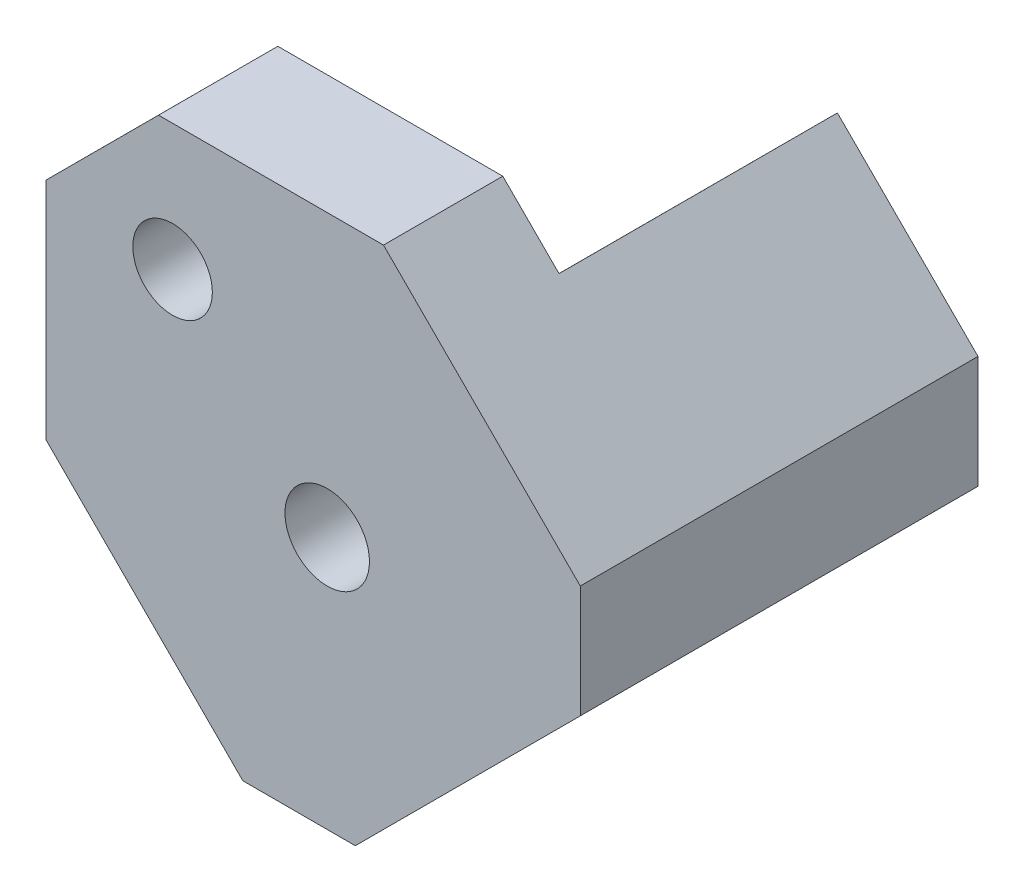
ISO-10303-21;
HEADER;
FILE_DESCRIPTION(('STEP AP214'),'2;1');
FILE_NAME('part.step','',(''),(''),'','','');
FILE_SCHEMA(('AUTOMOTIVE_DESIGN { 1 0 10303 214 1 1 1 1 }'));
ENDSEC;
DATA;
#1=APPLICATION_CONTEXT('core data for automotive mechanical design processes');
#2=APPLICATION_PROTOCOL_DEFINITION('international standard','automotive_design',2000,#1);
#3=PRODUCT_CONTEXT('',#1,'mechanical');
#4=PRODUCT('Part','Part','',(#3));
#5=PRODUCT_RELATED_PRODUCT_CATEGORY('part','',(#4));
#6=PRODUCT_DEFINITION_FORMATION('','',#4);
#7=PRODUCT_DEFINITION_CONTEXT('part definition',#1,'design');
#8=PRODUCT_DEFINITION('design','',#6,#7);
#9=PRODUCT_DEFINITION_SHAPE('','',#8);
#10=(LENGTH_UNIT() NAMED_UNIT(*) SI_UNIT(.MILLI.,.METRE.));
#11=(NAMED_UNIT(*) PLANE_ANGLE_UNIT() SI_UNIT($,.RADIAN.));
#12=(NAMED_UNIT(*) SI_UNIT($,.STERADIAN.) SOLID_ANGLE_UNIT());
#13=UNCERTAINTY_MEASURE_WITH_UNIT(LENGTH_MEASURE(1.E-05),#10,'distance_accuracy_value','');
#14=(GEOMETRIC_REPRESENTATION_CONTEXT(3) GLOBAL_UNCERTAINTY_ASSIGNED_CONTEXT((#13)) GLOBAL_UNIT_ASSIGNED_CONTEXT((#10,
#11,#12)) REPRESENTATION_CONTEXT('',''));
#15=CARTESIAN_POINT('',(0.,0.,0.));
#16=DIRECTION('',(0.,0.,1.));
#17=DIRECTION('',(1.,0.,0.));
#18=AXIS2_PLACEMENT_3D('',#15,#16,#17);
#19=CARTESIAN_POINT('',(97.1474811640959,-37.4199303249474,63.5));
#20=DIRECTION('',(-0.707188992132322,-0.707024560681502,0.));
#21=DIRECTION('',(0.707024560681502,-0.707188992132322,0.));
#22=AXIS2_PLACEMENT_3D('',#19,#20,#21);
#23=PLANE('',#22);
#24=DIRECTION('',(0.,0.,1.));
#25=VECTOR('',#24,1.);
#26=CARTESIAN_POINT('',(106.126693084751,-46.4012305250279,63.5));
#27=LINE('',#26,#25);
#28=CARTESIAN_POINT('',(106.126693084751,-46.4012305250279,0.));
#29=VERTEX_POINT('',#28);
#30=CARTESIAN_POINT('',(106.126693084751,-46.4012305250279,44.45));
#31=VERTEX_POINT('',#30);
#32=EDGE_CURVE('E66',#29,#31,#27,.T.);
#33=ORIENTED_EDGE('',*,*,#32,.T.);
#34=DIRECTION('',(-0.707024560681502,0.707188992132322,0.));
#35=VECTOR('',#34,1.);
#36=CARTESIAN_POINT('',(97.1474811640959,-37.4199303249474,44.45));
#37=LINE('',#36,#35);
#38=CARTESIAN_POINT('',(97.1474811640959,-37.4199303249474,44.45));
#39=VERTEX_POINT('',#38);
#40=EDGE_CURVE('E198',#31,#39,#37,.T.);
#41=ORIENTED_EDGE('',*,*,#40,.T.);
#42=DIRECTION('',(0.,0.,-1.));
#43=VECTOR('',#42,1.);
#44=CARTESIAN_POINT('',(97.1474811640959,-37.4199303249474,63.5));
#45=LINE('',#44,#43);
#46=CARTESIAN_POINT('',(97.1474811640959,-37.4199303249474,63.5));
#47=VERTEX_POINT('',#46);
#48=EDGE_CURVE('E13',#47,#39,#45,.T.);
#49=ORIENTED_EDGE('',*,*,#48,.F.);
#50=DIRECTION('',(-0.707024560681502,0.707188992132322,0.));
#51=VECTOR('',#50,1.);
#52=CARTESIAN_POINT('',(97.1474811640959,-37.4199303249474,63.5));
#53=LINE('',#52,#51);
#54=CARTESIAN_POINT('',(128.574722886389,-68.8544810252291,63.5));
#55=VERTEX_POINT('',#54);
#56=EDGE_CURVE('E160',#55,#47,#53,.T.);
#57=ORIENTED_EDGE('',*,*,#56,.F.);
#58=DIRECTION('',(0.,0.,-1.));
#59=VECTOR('',#58,1.);
#60=CARTESIAN_POINT('',(128.574722886389,-68.8544810252291,63.5));
#61=LINE('',#60,#59);
#62=CARTESIAN_POINT('',(128.574722886389,-68.8544810252291,0.));
#63=VERTEX_POINT('',#62);
#64=EDGE_CURVE('E161',#55,#63,#61,.T.);
#65=ORIENTED_EDGE('',*,*,#64,.T.);
#66=DIRECTION('',(-0.707024560681502,0.707188992132322,0.));
#67=VECTOR('',#66,1.);
#68=CARTESIAN_POINT('',(97.1474811640959,-37.4199303249474,0.));
#69=LINE('',#68,#67);
#70=EDGE_CURVE('E149',#63,#29,#69,.T.);
#71=ORIENTED_EDGE('',*,*,#70,.T.);
#72=EDGE_LOOP('',(#33,#41,#49,#57,#65,#71));
#73=FACE_BOUND('',#72,.T.);
#74=ADVANCED_FACE('F45',(#73),#23,.F.);
#75=CARTESIAN_POINT('',(61.2264569226248,-37.4157537660966,63.5));
#76=DIRECTION('',(-0.000116270593915752,-0.999999993240575,0.));
#77=DIRECTION('',(0.999999993240575,-0.000116270593915752,0.));
#78=AXIS2_PLACEMENT_3D('',#75,#76,#77);
#79=PLANE('',#78);
#80=ORIENTED_EDGE('',*,*,#48,.T.);
#81=DIRECTION('',(-0.999999993240575,0.000116270593915752,0.));
#82=VECTOR('',#81,1.);
#83=CARTESIAN_POINT('',(61.2264569226248,-37.4157537660966,44.45));
#84=LINE('',#83,#82);
#85=CARTESIAN_POINT('',(61.2264569226248,-37.4157537660965,44.45));
#86=VERTEX_POINT('',#85);
#87=EDGE_CURVE('E187',#39,#86,#84,.T.);
#88=ORIENTED_EDGE('',*,*,#87,.T.);
#89=DIRECTION('',(0.,0.,-1.));
#90=VECTOR('',#89,1.);
#91=CARTESIAN_POINT('',(61.2264569226248,-37.4157537660966,63.5));
#92=LINE('',#91,#90);
#93=CARTESIAN_POINT('',(61.2264569226248,-37.4157537660966,63.5));
#94=VERTEX_POINT('',#93);
#95=EDGE_CURVE('E53',#94,#86,#92,.T.);
#96=ORIENTED_EDGE('',*,*,#95,.F.);
#97=DIRECTION('',(-0.999999993240574,0.000116270593915752,0.));
#98=VECTOR('',#97,1.);
#99=CARTESIAN_POINT('',(61.2264569226248,-37.4157537660966,63.5));
#100=LINE('',#99,#98);
#101=EDGE_CURVE('E212',#47,#94,#100,.T.);
#102=ORIENTED_EDGE('',*,*,#101,.F.);
#103=EDGE_LOOP('',(#80,#88,#96,#102));
#104=FACE_BOUND('',#103,.T.);
#105=ADVANCED_FACE('F236',(#104),#79,.F.);
#106=CARTESIAN_POINT('',(61.2264569226248,-37.4157537660966,63.5));
#107=DIRECTION('',(0.707024560681502,-0.707188992132322,0.));
#108=DIRECTION('',(0.707188992132322,0.707024560681502,0.));
#109=AXIS2_PLACEMENT_3D('',#106,#107,#108);
#110=PLANE('',#109);
#111=ORIENTED_EDGE('',*,*,#95,.T.);
#112=DIRECTION('',(-0.707188992132322,-0.707024560681502,0.));
#113=VECTOR('',#112,1.);
#114=CARTESIAN_POINT('',(94.9084205273366,-3.7416216946858,44.45));
#115=LINE('',#114,#113);
#116=CARTESIAN_POINT('',(43.2638565224639,-55.3741776074067,44.45));
#117=VERTEX_POINT('',#116);
#118=EDGE_CURVE('E183',#86,#117,#115,.T.);
#119=ORIENTED_EDGE('',*,*,#118,.T.);
#120=DIRECTION('',(0.,0.,-1.));
#121=VECTOR('',#120,1.);
#122=CARTESIAN_POINT('',(43.2638565224638,-55.3741776074067,63.5));
#123=LINE('',#122,#121);
#124=CARTESIAN_POINT('',(43.2638565224638,-55.3741776074067,63.5));
#125=VERTEX_POINT('',#124);
#126=EDGE_CURVE('E176',#125,#117,#123,.T.);
#127=ORIENTED_EDGE('',*,*,#126,.F.);
#128=DIRECTION('',(-0.707188992132322,-0.707024560681502,0.));
#129=VECTOR('',#128,1.);
#130=CARTESIAN_POINT('',(61.2264569226248,-37.4157537660966,63.5));
#131=LINE('',#130,#129);
#132=EDGE_CURVE('E214',#94,#125,#131,.T.);
#133=ORIENTED_EDGE('',*,*,#132,.F.);
#134=EDGE_LOOP('',(#111,#119,#127,#133));
#135=FACE_BOUND('',#134,.T.);
#136=ADVANCED_FACE('F241',(#135),#110,.F.);
#137=CARTESIAN_POINT('',(43.2638565224638,-55.3741776074067,63.5));
#138=DIRECTION('',(0.999999993240575,-0.000116270593915559,0.));
#139=DIRECTION('',(0.000116270593915559,0.999999993240575,0.));
#140=AXIS2_PLACEMENT_3D('',#137,#138,#139);
#141=PLANE('',#140);
#142=ORIENTED_EDGE('',*,*,#126,.T.);
#143=DIRECTION('',(-0.000116270593915559,-0.999999993240575,0.));
#144=VECTOR('',#143,1.);
#145=CARTESIAN_POINT('',(43.2638565224638,-55.3741776074067,44.45));
#146=LINE('',#145,#144);
#147=CARTESIAN_POINT('',(43.259679963613,-91.2952018488778,44.45));
#148=VERTEX_POINT('',#147);
#149=EDGE_CURVE('E182',#117,#148,#146,.T.);
#150=ORIENTED_EDGE('',*,*,#149,.T.);
#151=DIRECTION('',(0.,0.,-1.));
#152=VECTOR('',#151,1.);
#153=CARTESIAN_POINT('',(43.259679963613,-91.2952018488778,63.5));
#154=LINE('',#153,#152);
#155=CARTESIAN_POINT('',(43.259679963613,-91.2952018488778,63.5));
#156=VERTEX_POINT('',#155);
#157=EDGE_CURVE('E174',#156,#148,#154,.T.);
#158=ORIENTED_EDGE('',*,*,#157,.F.);
#159=DIRECTION('',(-0.000116270593915559,-0.999999993240574,0.));
#160=VECTOR('',#159,1.);
#161=CARTESIAN_POINT('',(43.2638565224638,-55.3741776074067,63.5));
#162=LINE('',#161,#160);
#163=EDGE_CURVE('E216',#125,#156,#162,.T.);
#164=ORIENTED_EDGE('',*,*,#163,.F.);
#165=EDGE_LOOP('',(#142,#150,#158,#164));
#166=FACE_BOUND('',#165,.T.);
#167=ADVANCED_FACE('F243',(#166),#141,.F.);
#168=CARTESIAN_POINT('',(43.259679963613,-91.2952018488778,63.5));
#169=DIRECTION('',(0.707188992132322,0.707024560681502,0.));
#170=DIRECTION('',(-0.707024560681502,0.707188992132322,0.));
#171=AXIS2_PLACEMENT_3D('',#168,#169,#170);
#172=PLANE('',#171);
#173=ORIENTED_EDGE('',*,*,#157,.T.);
#174=DIRECTION('',(-0.707024560681501,0.707188992132322,0.));
#175=VECTOR('',#174,1.);
#176=CARTESIAN_POINT('',(52.2388918842681,-100.276502048958,44.45));
#177=LINE('',#176,#175);
#178=CARTESIAN_POINT('',(52.2388918842681,-100.276502048958,44.45));
#179=VERTEX_POINT('',#178);
#180=EDGE_CURVE('E134',#179,#148,#177,.T.);
#181=ORIENTED_EDGE('',*,*,#180,.F.);
#182=DIRECTION('',(0.,0.,1.));
#183=VECTOR('',#182,1.);
#184=CARTESIAN_POINT('',(52.2388918842681,-100.276502048958,0.));
#185=LINE('',#184,#183);
#186=CARTESIAN_POINT('',(52.2388918842681,-100.276502048958,0.));
#187=VERTEX_POINT('',#186);
#188=EDGE_CURVE('E127',#187,#179,#185,.T.);
#189=ORIENTED_EDGE('',*,*,#188,.F.);
#190=DIRECTION('',(0.707024560681502,-0.707188992132322,0.));
#191=VECTOR('',#190,1.);
#192=CARTESIAN_POINT('',(43.259679963613,-91.2952018488778,0.));
#193=LINE('',#192,#191);
#194=CARTESIAN_POINT('',(74.6869216859058,-122.72975254916,0.));
#195=VERTEX_POINT('',#194);
#196=EDGE_CURVE('E140',#187,#195,#193,.T.);
#197=ORIENTED_EDGE('',*,*,#196,.T.);
#198=DIRECTION('',(0.,0.,-1.));
#199=VECTOR('',#198,1.);
#200=CARTESIAN_POINT('',(74.6869216859058,-122.72975254916,63.5));
#201=LINE('',#200,#199);
#202=CARTESIAN_POINT('',(74.6869216859058,-122.72975254916,63.5));
#203=VERTEX_POINT('',#202);
#204=EDGE_CURVE('E172',#203,#195,#201,.T.);
#205=ORIENTED_EDGE('',*,*,#204,.F.);
#206=DIRECTION('',(0.707024560681502,-0.707188992132322,0.));
#207=VECTOR('',#206,1.);
#208=CARTESIAN_POINT('',(43.259679963613,-91.2952018488778,63.5));
#209=LINE('',#208,#207);
#210=EDGE_CURVE('E218',#156,#203,#209,.T.);
#211=ORIENTED_EDGE('',*,*,#210,.F.);
#212=EDGE_LOOP('',(#173,#181,#189,#197,#205,#211));
#213=FACE_BOUND('',#212,.T.);
#214=ADVANCED_FACE('F138',(#213),#172,.F.);
#215=CARTESIAN_POINT('',(92.6474338067014,-122.731840828525,63.5));
#216=DIRECTION('',(0.000116270590568872,0.999999993240575,0.));
#217=DIRECTION('',(-0.999999993240575,0.000116270590568872,0.));
#218=AXIS2_PLACEMENT_3D('',#215,#216,#217);
#219=PLANE('',#218);
#220=DIRECTION('',(0.999999993240575,-0.000116270590568872,0.));
#221=VECTOR('',#220,1.);
#222=CARTESIAN_POINT('',(92.6474338067014,-122.731840828525,0.));
#223=LINE('',#222,#221);
#224=CARTESIAN_POINT('',(92.6474338067014,-122.731840828525,0.));
#225=VERTEX_POINT('',#224);
#226=EDGE_CURVE('E148',#195,#225,#223,.T.);
#227=ORIENTED_EDGE('',*,*,#226,.T.);
#228=DIRECTION('',(0.,0.,-1.));
#229=VECTOR('',#228,1.);
#230=CARTESIAN_POINT('',(92.6474338067014,-122.731840828525,63.5));
#231=LINE('',#230,#229);
#232=CARTESIAN_POINT('',(92.6474338067014,-122.731840828525,25.4));
#233=VERTEX_POINT('',#232);
#234=EDGE_CURVE('E168',#233,#225,#231,.T.);
#235=ORIENTED_EDGE('',*,*,#234,.F.);
#236=CARTESIAN_POINT('',(92.6474338067014,-122.731840828525,63.5));
#237=VERTEX_POINT('',#236);
#238=EDGE_CURVE('E169',#237,#233,#231,.T.);
#239=ORIENTED_EDGE('',*,*,#238,.F.);
#240=DIRECTION('',(0.999999993240575,-0.000116270590568872,0.));
#241=VECTOR('',#240,1.);
#242=CARTESIAN_POINT('',(92.6474338067014,-122.731840828525,63.5));
#243=LINE('',#242,#241);
#244=EDGE_CURVE('E220',#203,#237,#243,.T.);
#245=ORIENTED_EDGE('',*,*,#244,.F.);
#246=ORIENTED_EDGE('',*,*,#204,.T.);
#247=EDGE_LOOP('',(#227,#235,#239,#245,#246));
#248=FACE_BOUND('',#247,.T.);
#249=ADVANCED_FACE('F249',(#248),#219,.F.);
#250=CARTESIAN_POINT('',(128.572634606963,-86.8149931459646,63.5));
#251=DIRECTION('',(-0.707024560681502,0.707188992132322,0.));
#252=DIRECTION('',(-0.707188992132322,-0.707024560681502,0.));
#253=AXIS2_PLACEMENT_3D('',#250,#251,#252);
#254=PLANE('',#253);
#255=ORIENTED_EDGE('',*,*,#238,.T.);
#256=CARTESIAN_POINT('',(97.1380839066816,-118.242234868257,25.4));
#257=DIRECTION('',(0.707024560681502,-0.707188992132321,0.));
#258=DIRECTION('',(0.707188992132321,0.707024560681502,0.));
#259=AXIS2_PLACEMENT_3D('',#256,#257,#258);
#260=CIRCLE('',#259,6.34999999999999);
#261=EDGE_CURVE('E59',#233,#233,#260,.T.);
#262=ORIENTED_EDGE('',*,*,#261,.F.);
#263=ORIENTED_EDGE('',*,*,#234,.T.);
#264=DIRECTION('',(0.707188992132322,0.707024560681502,0.));
#265=VECTOR('',#264,1.);
#266=CARTESIAN_POINT('',(128.572634606963,-86.8149931459646,0.));
#267=LINE('',#266,#265);
#268=CARTESIAN_POINT('',(128.572634606963,-86.8149931459646,0.));
#269=VERTEX_POINT('',#268);
#270=EDGE_CURVE('E151',#225,#269,#267,.T.);
#271=ORIENTED_EDGE('',*,*,#270,.T.);
#272=DIRECTION('',(0.,0.,-1.));
#273=VECTOR('',#272,1.);
#274=CARTESIAN_POINT('',(128.572634606963,-86.8149931459646,63.5));
#275=LINE('',#274,#273);
#276=CARTESIAN_POINT('',(128.572634606963,-86.8149931459646,63.5));
#277=VERTEX_POINT('',#276);
#278=EDGE_CURVE('E164',#277,#269,#275,.T.);
#279=ORIENTED_EDGE('',*,*,#278,.F.);
#280=DIRECTION('',(0.707188992132322,0.707024560681502,0.));
#281=VECTOR('',#280,1.);
#282=CARTESIAN_POINT('',(128.572634606963,-86.8149931459646,63.5));
#283=LINE('',#282,#281);
#284=EDGE_CURVE('E222',#237,#277,#283,.T.);
#285=ORIENTED_EDGE('',*,*,#284,.F.);
#286=EDGE_LOOP('',(#255,#262,#263,#271,#279,#285));
#287=FACE_BOUND('',#286,.T.);
#288=ADVANCED_FACE('F251',(#287),#254,.F.);
#289=CARTESIAN_POINT('',(128.574722886389,-68.8544810252291,63.5));
#290=DIRECTION('',(-0.999999993240575,0.000116270593913434,0.));
#291=DIRECTION('',(-0.000116270593913434,-0.999999993240575,0.));
#292=AXIS2_PLACEMENT_3D('',#289,#290,#291);
#293=PLANE('',#292);
#294=DIRECTION('',(0.000116270593913434,0.999999993240574,0.));
#295=VECTOR('',#294,1.);
#296=CARTESIAN_POINT('',(128.574722886389,-68.8544810252291,0.));
#297=LINE('',#296,#295);
#298=EDGE_CURVE('E158',#269,#63,#297,.T.);
#299=ORIENTED_EDGE('',*,*,#298,.T.);
#300=ORIENTED_EDGE('',*,*,#64,.F.);
#301=DIRECTION('',(0.000116270593913434,0.999999993240574,0.));
#302=VECTOR('',#301,1.);
#303=CARTESIAN_POINT('',(128.574722886389,-68.8544810252291,63.5));
#304=LINE('',#303,#302);
#305=EDGE_CURVE('E165',#277,#55,#304,.T.);
#306=ORIENTED_EDGE('',*,*,#305,.F.);
#307=ORIENTED_EDGE('',*,*,#278,.T.);
#308=EDGE_LOOP('',(#299,#300,#306,#307));
#309=FACE_BOUND('',#308,.T.);
#310=ADVANCED_FACE('F232',(#309),#293,.F.);
#311=CARTESIAN_POINT('',(79.1890573227858,-19.4573299247864,63.5));
#312=DIRECTION('',(0.,0.,-1.));
#313=DIRECTION('',(-1.,0.,0.));
#314=AXIS2_PLACEMENT_3D('',#311,#312,#313);
#315=PLANE('',#314);
#316=CARTESIAN_POINT('',(88.1620044051646,-82.3201664870736,63.5));
#317=DIRECTION('',(0.,0.,1.));
#318=DIRECTION('',(1.,0.,0.));
#319=AXIS2_PLACEMENT_3D('',#316,#317,#318);
#320=CIRCLE('',#319,6.74687499999999);
#321=CARTESIAN_POINT('',(94.9088794051646,-82.3201664870736,63.5));
#322=VERTEX_POINT('',#321);
#323=EDGE_CURVE('E202',#322,#322,#320,.T.);
#324=ORIENTED_EDGE('',*,*,#323,.F.);
#325=EDGE_LOOP('',(#324));
#326=FACE_BOUND('',#325,.T.);
#327=CARTESIAN_POINT('',(63.4691716233632,-57.6215909368522,63.5));
#328=DIRECTION('',(0.,0.,1.));
#329=DIRECTION('',(1.,0.,0.));
#330=AXIS2_PLACEMENT_3D('',#327,#328,#329);
#331=CIRCLE('',#330,6.34999999999999);
#332=CARTESIAN_POINT('',(69.8191716233632,-57.6215909368522,63.5));
#333=VERTEX_POINT('',#332);
#334=EDGE_CURVE('E153',#333,#333,#331,.T.);
#335=ORIENTED_EDGE('',*,*,#334,.F.);
#336=EDGE_LOOP('',(#335));
#337=FACE_BOUND('',#336,.T.);
#338=ORIENTED_EDGE('',*,*,#56,.T.);
#339=ORIENTED_EDGE('',*,*,#101,.T.);
#340=ORIENTED_EDGE('',*,*,#132,.T.);
#341=ORIENTED_EDGE('',*,*,#163,.T.);
#342=ORIENTED_EDGE('',*,*,#210,.T.);
#343=ORIENTED_EDGE('',*,*,#244,.T.);
#344=ORIENTED_EDGE('',*,*,#284,.T.);
#345=ORIENTED_EDGE('',*,*,#305,.T.);
#346=EDGE_LOOP('',(#338,#339,#340,#341,#342,#343,#344,#345));
#347=FACE_BOUND('',#346,.T.);
#348=ADVANCED_FACE('F226',(#326,#337,#347),#315,.F.);
#349=CARTESIAN_POINT('',(79.1890573227858,-19.4573299247864,0.));
#350=DIRECTION('',(0.,0.,-1.));
#351=DIRECTION('',(-1.,0.,0.));
#352=AXIS2_PLACEMENT_3D('',#349,#350,#351);
#353=PLANE('',#352);
#354=DIRECTION('',(-0.707188992132322,-0.707024560681502,0.));
#355=VECTOR('',#354,1.);
#356=CARTESIAN_POINT('',(121.846056289302,-30.6855222949273,0.));
#357=LINE('',#356,#355);
#358=EDGE_CURVE('E124',#29,#187,#357,.T.);
#359=ORIENTED_EDGE('',*,*,#358,.F.);
#360=ORIENTED_EDGE('',*,*,#70,.F.);
#361=ORIENTED_EDGE('',*,*,#298,.F.);
#362=ORIENTED_EDGE('',*,*,#270,.F.);
#363=ORIENTED_EDGE('',*,*,#226,.F.);
#364=ORIENTED_EDGE('',*,*,#196,.F.);
#365=EDGE_LOOP('',(#359,#360,#361,#362,#363,#364));
#366=FACE_BOUND('',#365,.T.);
#367=CARTESIAN_POINT('',(88.1620044051646,-82.3201664870736,0.));
#368=DIRECTION('',(0.,0.,1.));
#369=DIRECTION('',(1.,0.,0.));
#370=AXIS2_PLACEMENT_3D('',#367,#368,#369);
#371=CIRCLE('',#370,6.74687499999999);
#372=CARTESIAN_POINT('',(94.9088794051646,-82.3201664870736,0.));
#373=VERTEX_POINT('',#372);
#374=EDGE_CURVE('E205',#373,#373,#371,.T.);
#375=ORIENTED_EDGE('',*,*,#374,.T.);
#376=EDGE_LOOP('',(#375));
#377=FACE_BOUND('',#376,.T.);
#378=ADVANCED_FACE('F144',(#366,#377),#353,.T.);
#379=CARTESIAN_POINT('',(63.4691716233632,-57.6215909368522,63.5));
#380=DIRECTION('',(0.,0.,1.));
#381=DIRECTION('',(1.,0.,0.));
#382=AXIS2_PLACEMENT_3D('',#379,#380,#381);
#383=CYLINDRICAL_SURFACE('',#382,6.34999999999999);
#384=CARTESIAN_POINT('',(63.4691716233632,-57.6215909368522,44.45));
#385=DIRECTION('',(0.,0.,1.));
#386=DIRECTION('',(1.,0.,0.));
#387=AXIS2_PLACEMENT_3D('',#384,#385,#386);
#388=CIRCLE('',#387,6.34999999999999);
#389=CARTESIAN_POINT('',(69.8191716233631,-57.6215909368522,44.45));
#390=VERTEX_POINT('',#389);
#391=EDGE_CURVE('E180',#390,#390,#388,.F.);
#392=ORIENTED_EDGE('',*,*,#391,.T.);
#393=EDGE_LOOP('',(#392));
#394=FACE_BOUND('',#393,.T.);
#395=ORIENTED_EDGE('',*,*,#334,.T.);
#396=EDGE_LOOP('',(#395));
#397=FACE_BOUND('',#396,.T.);
#398=ADVANCED_FACE('F287',(#394,#397),#383,.F.);
#399=CARTESIAN_POINT('',(88.1620044051646,-82.3201664870736,63.5));
#400=DIRECTION('',(0.,0.,1.));
#401=DIRECTION('',(1.,0.,0.));
#402=AXIS2_PLACEMENT_3D('',#399,#400,#401);
#403=CYLINDRICAL_SURFACE('',#402,6.74687499999999);
#404=ORIENTED_EDGE('',*,*,#374,.F.);
#405=EDGE_LOOP('',(#404));
#406=FACE_BOUND('',#405,.T.);
#407=ORIENTED_EDGE('',*,*,#323,.T.);
#408=EDGE_LOOP('',(#407));
#409=FACE_BOUND('',#408,.T.);
#410=ADVANCED_FACE('F293',(#406,#409),#403,.F.);
#411=CARTESIAN_POINT('',(121.846056289302,-30.6855222949273,0.));
#412=DIRECTION('',(0.707024560681502,-0.707188992132322,0.));
#413=DIRECTION('',(0.707188992132322,0.707024560681502,0.));
#414=AXIS2_PLACEMENT_3D('',#411,#412,#413);
#415=PLANE('',#414);
#416=CARTESIAN_POINT('',(65.7108421843888,-86.8076841679757,25.4));
#417=DIRECTION('',(0.707024560681502,-0.707188992132322,0.));
#418=DIRECTION('',(0.707188992132322,0.707024560681502,0.));
#419=AXIS2_PLACEMENT_3D('',#416,#417,#418);
#420=CIRCLE('',#419,6.34999999999998);
#421=CARTESIAN_POINT('',(70.201492284429,-82.3180782076482,25.4));
#422=VERTEX_POINT('',#421);
#423=EDGE_CURVE('E48',#422,#422,#420,.T.);
#424=ORIENTED_EDGE('',*,*,#423,.T.);
#425=EDGE_LOOP('',(#424));
#426=FACE_BOUND('',#425,.T.);
#427=ORIENTED_EDGE('',*,*,#358,.T.);
#428=ORIENTED_EDGE('',*,*,#188,.T.);
#429=DIRECTION('',(-0.707188992132322,-0.707024560681502,0.));
#430=VECTOR('',#429,1.);
#431=CARTESIAN_POINT('',(121.846056289302,-30.6855222949273,44.45));
#432=LINE('',#431,#430);
#433=EDGE_CURVE('E133',#31,#179,#432,.T.);
#434=ORIENTED_EDGE('',*,*,#433,.F.);
#435=ORIENTED_EDGE('',*,*,#32,.F.);
#436=EDGE_LOOP('',(#427,#428,#434,#435));
#437=FACE_BOUND('',#436,.T.);
#438=ADVANCED_FACE('F126',(#426,#437),#415,.F.);
#439=CARTESIAN_POINT('',(121.846056289302,-30.6855222949273,44.45));
#440=DIRECTION('',(0.,0.,1.));
#441=DIRECTION('',(1.,0.,0.));
#442=AXIS2_PLACEMENT_3D('',#439,#440,#441);
#443=PLANE('',#442);
#444=ORIENTED_EDGE('',*,*,#391,.F.);
#445=EDGE_LOOP('',(#444));
#446=FACE_BOUND('',#445,.T.);
#447=ORIENTED_EDGE('',*,*,#433,.T.);
#448=ORIENTED_EDGE('',*,*,#180,.T.);
#449=ORIENTED_EDGE('',*,*,#149,.F.);
#450=ORIENTED_EDGE('',*,*,#118,.F.);
#451=ORIENTED_EDGE('',*,*,#87,.F.);
#452=ORIENTED_EDGE('',*,*,#40,.F.);
#453=EDGE_LOOP('',(#447,#448,#449,#450,#451,#452));
#454=FACE_BOUND('',#453,.T.);
#455=ADVANCED_FACE('F259',(#446,#454),#443,.F.);
#456=CARTESIAN_POINT('',(97.1380839066816,-118.242234868257,25.4));
#457=DIRECTION('',(0.707024560681502,-0.707188992132321,0.));
#458=DIRECTION('',(0.707188992132321,0.707024560681502,0.));
#459=AXIS2_PLACEMENT_3D('',#456,#457,#458);
#460=CYLINDRICAL_SURFACE('',#459,6.34999999999998);
#461=ORIENTED_EDGE('',*,*,#261,.T.);
#462=EDGE_LOOP('',(#461));
#463=FACE_BOUND('',#462,.T.);
#464=ORIENTED_EDGE('',*,*,#423,.F.);
#465=EDGE_LOOP('',(#464));
#466=FACE_BOUND('',#465,.T.);
#467=ADVANCED_FACE('F257',(#463,#466),#460,.F.);
#468=CLOSED_SHELL('',(#74,#105,#136,#167,#214,#249,#288,#310,#348,#378,#398,#410,#438,#455,#467));
#469=MANIFOLD_SOLID_BREP('B2',#468);
#470=ADVANCED_BREP_SHAPE_REPRESENTATION('',(#18,#469),#14);
#471=SHAPE_DEFINITION_REPRESENTATION(#9,#470);
ENDSEC;
END-ISO-10303-21;
